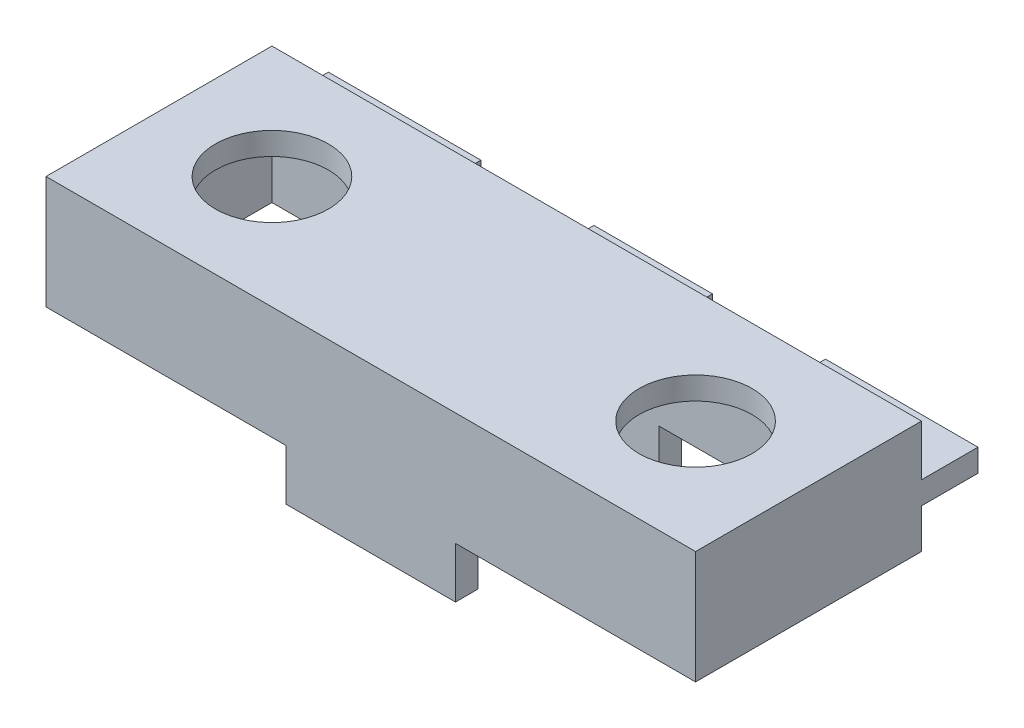
ISO-10303-21;
HEADER;
FILE_DESCRIPTION(('STEP AP214'),'2;1');
FILE_NAME('part.step','',(''),(''),'','','');
FILE_SCHEMA(('AUTOMOTIVE_DESIGN { 1 0 10303 214 1 1 1 1 }'));
ENDSEC;
DATA;
#1=APPLICATION_CONTEXT('core data for automotive mechanical design processes');
#2=APPLICATION_PROTOCOL_DEFINITION('international standard','automotive_design',2000,#1);
#3=PRODUCT_CONTEXT('',#1,'mechanical');
#4=PRODUCT('Part','Part','',(#3));
#5=PRODUCT_RELATED_PRODUCT_CATEGORY('part','',(#4));
#6=PRODUCT_DEFINITION_FORMATION('','',#4);
#7=PRODUCT_DEFINITION_CONTEXT('part definition',#1,'design');
#8=PRODUCT_DEFINITION('design','',#6,#7);
#9=PRODUCT_DEFINITION_SHAPE('','',#8);
#10=(LENGTH_UNIT() NAMED_UNIT(*) SI_UNIT(.MILLI.,.METRE.));
#11=(NAMED_UNIT(*) PLANE_ANGLE_UNIT() SI_UNIT($,.RADIAN.));
#12=(NAMED_UNIT(*) SI_UNIT($,.STERADIAN.) SOLID_ANGLE_UNIT());
#13=UNCERTAINTY_MEASURE_WITH_UNIT(LENGTH_MEASURE(1.E-05),#10,'distance_accuracy_value','');
#14=(GEOMETRIC_REPRESENTATION_CONTEXT(3) GLOBAL_UNCERTAINTY_ASSIGNED_CONTEXT((#13)) GLOBAL_UNIT_ASSIGNED_CONTEXT((#10,
#11,#12)) REPRESENTATION_CONTEXT('',''));
#15=CARTESIAN_POINT('',(0.,0.,0.));
#16=DIRECTION('',(0.,0.,1.));
#17=DIRECTION('',(1.,0.,0.));
#18=AXIS2_PLACEMENT_3D('',#15,#16,#17);
#19=CARTESIAN_POINT('',(0.,-25.4,-50.8));
#20=DIRECTION('',(0.,0.,-1.));
#21=DIRECTION('',(-1.,0.,0.));
#22=AXIS2_PLACEMENT_3D('',#19,#20,#21);
#23=PLANE('',#22);
#24=DIRECTION('',(-1.,0.,0.));
#25=VECTOR('',#24,1.);
#26=CARTESIAN_POINT('',(86.36,-16.51,-50.8));
#27=LINE('',#26,#25);
#28=CARTESIAN_POINT('',(86.36,-16.51,-50.8));
#29=VERTEX_POINT('',#28);
#30=CARTESIAN_POINT('',(59.69,-16.51,-50.8));
#31=VERTEX_POINT('',#30);
#32=EDGE_CURVE('E291',#29,#31,#27,.T.);
#33=ORIENTED_EDGE('',*,*,#32,.F.);
#34=DIRECTION('',(0.,-1.,0.));
#35=VECTOR('',#34,1.);
#36=CARTESIAN_POINT('',(86.36,-11.43,-50.8));
#37=LINE('',#36,#35);
#38=CARTESIAN_POINT('',(86.36,-11.43,-50.8));
#39=VERTEX_POINT('',#38);
#40=EDGE_CURVE('E288',#39,#29,#37,.T.);
#41=ORIENTED_EDGE('',*,*,#40,.F.);
#42=DIRECTION('',(1.,0.,0.));
#43=VECTOR('',#42,1.);
#44=CARTESIAN_POINT('',(86.36,-11.43,-50.8));
#45=LINE('',#44,#43);
#46=CARTESIAN_POINT('',(59.69,-11.43,-50.8));
#47=VERTEX_POINT('',#46);
#48=EDGE_CURVE('E301',#47,#39,#45,.T.);
#49=ORIENTED_EDGE('',*,*,#48,.F.);
#50=DIRECTION('',(0.,1.,0.));
#51=VECTOR('',#50,1.);
#52=CARTESIAN_POINT('',(59.69,-11.43,-50.8));
#53=LINE('',#52,#51);
#54=EDGE_CURVE('E309',#31,#47,#53,.T.);
#55=ORIENTED_EDGE('',*,*,#54,.F.);
#56=EDGE_LOOP('',(#33,#41,#49,#55));
#57=FACE_BOUND('',#56,.T.);
#58=DIRECTION('',(0.,1.,0.));
#59=VECTOR('',#58,1.);
#60=CARTESIAN_POINT('',(0.,-25.4,-50.8));
#61=LINE('',#60,#59);
#62=CARTESIAN_POINT('',(0.,-25.4,-50.8));
#63=VERTEX_POINT('',#62);
#64=CARTESIAN_POINT('',(0.,-16.51,-50.8));
#65=VERTEX_POINT('',#64);
#66=EDGE_CURVE('E12',#63,#65,#61,.T.);
#67=ORIENTED_EDGE('',*,*,#66,.T.);
#68=DIRECTION('',(-1.,0.,0.));
#69=VECTOR('',#68,1.);
#70=CARTESIAN_POINT('',(34.29,-16.51,-50.8));
#71=LINE('',#70,#69);
#72=CARTESIAN_POINT('',(34.29,-16.51,-50.8));
#73=VERTEX_POINT('',#72);
#74=EDGE_CURVE('E97',#73,#65,#71,.T.);
#75=ORIENTED_EDGE('',*,*,#74,.F.);
#76=DIRECTION('',(0.,-1.,0.));
#77=VECTOR('',#76,1.);
#78=CARTESIAN_POINT('',(34.29,-11.43,-50.8));
#79=LINE('',#78,#77);
#80=CARTESIAN_POINT('',(34.29,-11.43,-50.8));
#81=VERTEX_POINT('',#80);
#82=EDGE_CURVE('E102',#81,#73,#79,.T.);
#83=ORIENTED_EDGE('',*,*,#82,.F.);
#84=DIRECTION('',(1.,0.,0.));
#85=VECTOR('',#84,1.);
#86=CARTESIAN_POINT('',(34.29,-11.43,-50.8));
#87=LINE('',#86,#85);
#88=CARTESIAN_POINT('',(0.,-11.43,-50.8));
#89=VERTEX_POINT('',#88);
#90=EDGE_CURVE('E285',#89,#81,#87,.T.);
#91=ORIENTED_EDGE('',*,*,#90,.F.);
#92=CARTESIAN_POINT('',(0.,0.,-50.8));
#93=VERTEX_POINT('',#92);
#94=EDGE_CURVE('E90',#89,#93,#61,.T.);
#95=ORIENTED_EDGE('',*,*,#94,.T.);
#96=DIRECTION('',(-1.,0.,0.));
#97=VECTOR('',#96,1.);
#98=CARTESIAN_POINT('',(0.,0.,-50.8));
#99=LINE('',#98,#97);
#100=CARTESIAN_POINT('',(146.05,0.,-50.8));
#101=VERTEX_POINT('',#100);
#102=EDGE_CURVE('E449',#101,#93,#99,.T.);
#103=ORIENTED_EDGE('',*,*,#102,.F.);
#104=DIRECTION('',(0.,1.,0.));
#105=VECTOR('',#104,1.);
#106=CARTESIAN_POINT('',(146.05,-25.4,-50.8));
#107=LINE('',#106,#105);
#108=CARTESIAN_POINT('',(146.05,-11.43,-50.8));
#109=VERTEX_POINT('',#108);
#110=EDGE_CURVE('E474',#109,#101,#107,.T.);
#111=ORIENTED_EDGE('',*,*,#110,.F.);
#112=DIRECTION('',(1.,0.,0.));
#113=VECTOR('',#112,1.);
#114=CARTESIAN_POINT('',(146.05,-11.43,-50.8));
#115=LINE('',#114,#113);
#116=CARTESIAN_POINT('',(111.76,-11.43,-50.8));
#117=VERTEX_POINT('',#116);
#118=EDGE_CURVE('E327',#117,#109,#115,.T.);
#119=ORIENTED_EDGE('',*,*,#118,.F.);
#120=DIRECTION('',(0.,1.,0.));
#121=VECTOR('',#120,1.);
#122=CARTESIAN_POINT('',(111.76,-11.43,-50.8));
#123=LINE('',#122,#121);
#124=CARTESIAN_POINT('',(111.76,-16.51,-50.8));
#125=VERTEX_POINT('',#124);
#126=EDGE_CURVE('E336',#125,#117,#123,.T.);
#127=ORIENTED_EDGE('',*,*,#126,.F.);
#128=DIRECTION('',(-1.,0.,0.));
#129=VECTOR('',#128,1.);
#130=CARTESIAN_POINT('',(146.05,-16.51,-50.8));
#131=LINE('',#130,#129);
#132=CARTESIAN_POINT('',(146.05,-16.51,-50.8));
#133=VERTEX_POINT('',#132);
#134=EDGE_CURVE('E322',#133,#125,#131,.T.);
#135=ORIENTED_EDGE('',*,*,#134,.F.);
#136=CARTESIAN_POINT('',(146.05,-25.4,-50.8));
#137=VERTEX_POINT('',#136);
#138=EDGE_CURVE('E471',#137,#133,#107,.T.);
#139=ORIENTED_EDGE('',*,*,#138,.F.);
#140=DIRECTION('',(-1.,0.,0.));
#141=VECTOR('',#140,1.);
#142=CARTESIAN_POINT('',(0.,-25.4,-50.8));
#143=LINE('',#142,#141);
#144=CARTESIAN_POINT('',(92.075,-25.4,-50.8));
#145=VERTEX_POINT('',#144);
#146=EDGE_CURVE('E457',#137,#145,#143,.T.);
#147=ORIENTED_EDGE('',*,*,#146,.T.);
#148=DIRECTION('',(0.,1.,0.));
#149=VECTOR('',#148,1.);
#150=CARTESIAN_POINT('',(92.075,-36.83,-50.8));
#151=LINE('',#150,#149);
#152=CARTESIAN_POINT('',(92.075,-36.83,-50.8));
#153=VERTEX_POINT('',#152);
#154=EDGE_CURVE('E392',#153,#145,#151,.T.);
#155=ORIENTED_EDGE('',*,*,#154,.F.);
#156=DIRECTION('',(-1.,0.,0.));
#157=VECTOR('',#156,1.);
#158=CARTESIAN_POINT('',(73.025,-36.83,-50.8));
#159=LINE('',#158,#157);
#160=CARTESIAN_POINT('',(53.975,-36.83,-50.8));
#161=VERTEX_POINT('',#160);
#162=EDGE_CURVE('E381',#153,#161,#159,.T.);
#163=ORIENTED_EDGE('',*,*,#162,.T.);
#164=DIRECTION('',(0.,1.,0.));
#165=VECTOR('',#164,1.);
#166=CARTESIAN_POINT('',(53.975,-36.83,-50.8));
#167=LINE('',#166,#165);
#168=CARTESIAN_POINT('',(53.975,-25.4,-50.8));
#169=VERTEX_POINT('',#168);
#170=EDGE_CURVE('E389',#161,#169,#167,.T.);
#171=ORIENTED_EDGE('',*,*,#170,.T.);
#172=EDGE_CURVE('E456',#169,#63,#143,.T.);
#173=ORIENTED_EDGE('',*,*,#172,.T.);
#174=EDGE_LOOP('',(#67,#75,#83,#91,#95,#103,#111,#119,#127,#135,#139,#147,#155,#163,#171,#173));
#175=FACE_BOUND('',#174,.T.);
#176=ADVANCED_FACE('F81',(#57,#175),#23,.T.);
#177=CARTESIAN_POINT('',(0.,-25.4,0.));
#178=DIRECTION('',(0.,-1.,0.));
#179=DIRECTION('',(0.,0.,-1.));
#180=AXIS2_PLACEMENT_3D('',#177,#178,#179);
#181=PLANE('',#180);
#182=DIRECTION('',(0.,0.,-1.));
#183=VECTOR('',#182,1.);
#184=CARTESIAN_POINT('',(92.075,-25.4,0.));
#185=LINE('',#184,#183);
#186=CARTESIAN_POINT('',(92.075,-25.4,0.));
#187=VERTEX_POINT('',#186);
#188=CARTESIAN_POINT('',(92.075,-25.4,-5.08));
#189=VERTEX_POINT('',#188);
#190=EDGE_CURVE('E357',#187,#189,#185,.T.);
#191=ORIENTED_EDGE('',*,*,#190,.T.);
#192=DIRECTION('',(1.,0.,0.));
#193=VECTOR('',#192,1.);
#194=CARTESIAN_POINT('',(0.,-25.4,-5.08));
#195=LINE('',#194,#193);
#196=CARTESIAN_POINT('',(140.97,-25.4,-5.08));
#197=VERTEX_POINT('',#196);
#198=EDGE_CURVE('E436',#189,#197,#195,.T.);
#199=ORIENTED_EDGE('',*,*,#198,.T.);
#200=DIRECTION('',(0.,0.,-1.));
#201=VECTOR('',#200,1.);
#202=CARTESIAN_POINT('',(140.97,-25.4,0.));
#203=LINE('',#202,#201);
#204=CARTESIAN_POINT('',(140.97,-25.4,-45.72));
#205=VERTEX_POINT('',#204);
#206=EDGE_CURVE('E440',#197,#205,#203,.T.);
#207=ORIENTED_EDGE('',*,*,#206,.T.);
#208=DIRECTION('',(-1.,0.,0.));
#209=VECTOR('',#208,1.);
#210=CARTESIAN_POINT('',(0.,-25.4,-45.72));
#211=LINE('',#210,#209);
#212=CARTESIAN_POINT('',(92.075,-25.4,-45.72));
#213=VERTEX_POINT('',#212);
#214=EDGE_CURVE('E422',#205,#213,#211,.T.);
#215=ORIENTED_EDGE('',*,*,#214,.T.);
#216=DIRECTION('',(0.,0.,-1.));
#217=VECTOR('',#216,1.);
#218=CARTESIAN_POINT('',(92.075,-25.4,-45.72));
#219=LINE('',#218,#217);
#220=EDGE_CURVE('E363',#213,#145,#219,.T.);
#221=ORIENTED_EDGE('',*,*,#220,.T.);
#222=ORIENTED_EDGE('',*,*,#146,.F.);
#223=DIRECTION('',(0.,0.,-1.));
#224=VECTOR('',#223,1.);
#225=CARTESIAN_POINT('',(146.05,-25.4,0.));
#226=LINE('',#225,#224);
#227=CARTESIAN_POINT('',(146.05,-25.4,0.));
#228=VERTEX_POINT('',#227);
#229=EDGE_CURVE('E453',#228,#137,#226,.T.);
#230=ORIENTED_EDGE('',*,*,#229,.F.);
#231=DIRECTION('',(1.,0.,0.));
#232=VECTOR('',#231,1.);
#233=CARTESIAN_POINT('',(0.,-25.4,0.));
#234=LINE('',#233,#232);
#235=EDGE_CURVE('E448',#187,#228,#234,.T.);
#236=ORIENTED_EDGE('',*,*,#235,.F.);
#237=EDGE_LOOP('',(#191,#199,#207,#215,#221,#222,#230,#236));
#238=FACE_BOUND('',#237,.T.);
#239=ADVANCED_FACE('F530',(#238),#181,.T.);
#240=DIRECTION('',(0.,0.,1.));
#241=VECTOR('',#240,1.);
#242=CARTESIAN_POINT('',(53.975,-25.4,-5.08));
#243=LINE('',#242,#241);
#244=CARTESIAN_POINT('',(53.975,-25.4,-5.08));
#245=VERTEX_POINT('',#244);
#246=CARTESIAN_POINT('',(53.975,-25.4,0.));
#247=VERTEX_POINT('',#246);
#248=EDGE_CURVE('E361',#245,#247,#243,.T.);
#249=ORIENTED_EDGE('',*,*,#248,.T.);
#250=CARTESIAN_POINT('',(0.,-25.4,0.));
#251=VERTEX_POINT('',#250);
#252=EDGE_CURVE('E450',#251,#247,#234,.T.);
#253=ORIENTED_EDGE('',*,*,#252,.F.);
#254=DIRECTION('',(0.,0.,1.));
#255=VECTOR('',#254,1.);
#256=CARTESIAN_POINT('',(0.,-25.4,0.));
#257=LINE('',#256,#255);
#258=EDGE_CURVE('E445',#63,#251,#257,.T.);
#259=ORIENTED_EDGE('',*,*,#258,.F.);
#260=ORIENTED_EDGE('',*,*,#172,.F.);
#261=DIRECTION('',(0.,0.,-1.));
#262=VECTOR('',#261,1.);
#263=CARTESIAN_POINT('',(53.975,-25.4,-45.72));
#264=LINE('',#263,#262);
#265=CARTESIAN_POINT('',(53.975,-25.4,-45.72));
#266=VERTEX_POINT('',#265);
#267=EDGE_CURVE('E385',#266,#169,#264,.T.);
#268=ORIENTED_EDGE('',*,*,#267,.F.);
#269=CARTESIAN_POINT('',(5.08,-25.4,-45.72));
#270=VERTEX_POINT('',#269);
#271=EDGE_CURVE('E439',#266,#270,#211,.T.);
#272=ORIENTED_EDGE('',*,*,#271,.T.);
#273=DIRECTION('',(0.,0.,1.));
#274=VECTOR('',#273,1.);
#275=CARTESIAN_POINT('',(5.08,-25.4,0.));
#276=LINE('',#275,#274);
#277=CARTESIAN_POINT('',(5.08,-25.4,-5.08));
#278=VERTEX_POINT('',#277);
#279=EDGE_CURVE('E426',#270,#278,#276,.T.);
#280=ORIENTED_EDGE('',*,*,#279,.T.);
#281=EDGE_CURVE('E443',#278,#245,#195,.T.);
#282=ORIENTED_EDGE('',*,*,#281,.T.);
#283=EDGE_LOOP('',(#249,#253,#259,#260,#268,#272,#280,#282));
#284=FACE_BOUND('',#283,.T.);
#285=ADVANCED_FACE('F512',(#284),#181,.T.);
#286=CARTESIAN_POINT('',(0.,-25.4,0.));
#287=DIRECTION('',(-1.,0.,0.));
#288=DIRECTION('',(0.,0.,1.));
#289=AXIS2_PLACEMENT_3D('',#286,#287,#288);
#290=PLANE('',#289);
#291=DIRECTION('',(0.,0.,1.));
#292=VECTOR('',#291,1.);
#293=CARTESIAN_POINT('',(0.,0.,0.));
#294=LINE('',#293,#292);
#295=CARTESIAN_POINT('',(0.,0.,0.));
#296=VERTEX_POINT('',#295);
#297=EDGE_CURVE('E417',#93,#296,#294,.T.);
#298=ORIENTED_EDGE('',*,*,#297,.F.);
#299=ORIENTED_EDGE('',*,*,#94,.F.);
#300=DIRECTION('',(0.,0.,1.));
#301=VECTOR('',#300,1.);
#302=CARTESIAN_POINT('',(0.,-11.43,-63.5));
#303=LINE('',#302,#301);
#304=CARTESIAN_POINT('',(0.,-11.43,-63.5));
#305=VERTEX_POINT('',#304);
#306=EDGE_CURVE('E293',#305,#89,#303,.T.);
#307=ORIENTED_EDGE('',*,*,#306,.F.);
#308=DIRECTION('',(0.,1.,0.));
#309=VECTOR('',#308,1.);
#310=CARTESIAN_POINT('',(0.,-11.43,-63.5));
#311=LINE('',#310,#309);
#312=CARTESIAN_POINT('',(0.,-16.51,-63.5));
#313=VERTEX_POINT('',#312);
#314=EDGE_CURVE('E275',#313,#305,#311,.T.);
#315=ORIENTED_EDGE('',*,*,#314,.F.);
#316=DIRECTION('',(0.,0.,1.));
#317=VECTOR('',#316,1.);
#318=CARTESIAN_POINT('',(0.,-16.51,-63.5));
#319=LINE('',#318,#317);
#320=EDGE_CURVE('E272',#313,#65,#319,.T.);
#321=ORIENTED_EDGE('',*,*,#320,.T.);
#322=ORIENTED_EDGE('',*,*,#66,.F.);
#323=ORIENTED_EDGE('',*,*,#258,.T.);
#324=DIRECTION('',(0.,1.,0.));
#325=VECTOR('',#324,1.);
#326=CARTESIAN_POINT('',(0.,-25.4,0.));
#327=LINE('',#326,#325);
#328=EDGE_CURVE('E460',#251,#296,#327,.T.);
#329=ORIENTED_EDGE('',*,*,#328,.T.);
#330=EDGE_LOOP('',(#298,#299,#307,#315,#321,#322,#323,#329));
#331=FACE_BOUND('',#330,.T.);
#332=ADVANCED_FACE('F83',(#331),#290,.T.);
#333=CARTESIAN_POINT('',(146.05,-25.4,0.));
#334=DIRECTION('',(1.,0.,0.));
#335=DIRECTION('',(0.,0.,-1.));
#336=AXIS2_PLACEMENT_3D('',#333,#334,#335);
#337=PLANE('',#336);
#338=DIRECTION('',(0.,0.,-1.));
#339=VECTOR('',#338,1.);
#340=CARTESIAN_POINT('',(146.05,0.,0.));
#341=LINE('',#340,#339);
#342=CARTESIAN_POINT('',(146.05,0.,0.));
#343=VERTEX_POINT('',#342);
#344=EDGE_CURVE('E466',#343,#101,#341,.T.);
#345=ORIENTED_EDGE('',*,*,#344,.F.);
#346=DIRECTION('',(0.,1.,0.));
#347=VECTOR('',#346,1.);
#348=CARTESIAN_POINT('',(146.05,-25.4,0.));
#349=LINE('',#348,#347);
#350=EDGE_CURVE('E475',#228,#343,#349,.T.);
#351=ORIENTED_EDGE('',*,*,#350,.F.);
#352=ORIENTED_EDGE('',*,*,#229,.T.);
#353=ORIENTED_EDGE('',*,*,#138,.T.);
#354=DIRECTION('',(0.,0.,1.));
#355=VECTOR('',#354,1.);
#356=CARTESIAN_POINT('',(146.05,-16.51,-63.5));
#357=LINE('',#356,#355);
#358=CARTESIAN_POINT('',(146.05,-16.51,-63.5));
#359=VERTEX_POINT('',#358);
#360=EDGE_CURVE('E349',#359,#133,#357,.T.);
#361=ORIENTED_EDGE('',*,*,#360,.F.);
#362=DIRECTION('',(0.,-1.,0.));
#363=VECTOR('',#362,1.);
#364=CARTESIAN_POINT('',(146.05,-11.43,-63.5));
#365=LINE('',#364,#363);
#366=CARTESIAN_POINT('',(146.05,-11.43,-63.5));
#367=VERTEX_POINT('',#366);
#368=EDGE_CURVE('E323',#367,#359,#365,.T.);
#369=ORIENTED_EDGE('',*,*,#368,.F.);
#370=DIRECTION('',(0.,0.,1.));
#371=VECTOR('',#370,1.);
#372=CARTESIAN_POINT('',(146.05,-11.43,-63.5));
#373=LINE('',#372,#371);
#374=EDGE_CURVE('E333',#367,#109,#373,.T.);
#375=ORIENTED_EDGE('',*,*,#374,.T.);
#376=ORIENTED_EDGE('',*,*,#110,.T.);
#377=EDGE_LOOP('',(#345,#351,#352,#353,#361,#369,#375,#376));
#378=FACE_BOUND('',#377,.T.);
#379=ADVANCED_FACE('F556',(#378),#337,.T.);
#380=CARTESIAN_POINT('',(0.,-25.4,0.));
#381=DIRECTION('',(0.,0.,1.));
#382=DIRECTION('',(1.,0.,0.));
#383=AXIS2_PLACEMENT_3D('',#380,#381,#382);
#384=PLANE('',#383);
#385=DIRECTION('',(1.,0.,0.));
#386=VECTOR('',#385,1.);
#387=CARTESIAN_POINT('',(0.,0.,0.));
#388=LINE('',#387,#386);
#389=EDGE_CURVE('E463',#296,#343,#388,.T.);
#390=ORIENTED_EDGE('',*,*,#389,.F.);
#391=ORIENTED_EDGE('',*,*,#328,.F.);
#392=ORIENTED_EDGE('',*,*,#252,.T.);
#393=DIRECTION('',(0.,1.,0.));
#394=VECTOR('',#393,1.);
#395=CARTESIAN_POINT('',(53.975,-36.83,0.));
#396=LINE('',#395,#394);
#397=CARTESIAN_POINT('',(53.975,-36.83,0.));
#398=VERTEX_POINT('',#397);
#399=EDGE_CURVE('E353',#398,#247,#396,.T.);
#400=ORIENTED_EDGE('',*,*,#399,.F.);
#401=DIRECTION('',(-1.,0.,0.));
#402=VECTOR('',#401,1.);
#403=CARTESIAN_POINT('',(73.025,-36.83,0.));
#404=LINE('',#403,#402);
#405=CARTESIAN_POINT('',(92.075,-36.83,0.));
#406=VERTEX_POINT('',#405);
#407=EDGE_CURVE('E364',#406,#398,#404,.T.);
#408=ORIENTED_EDGE('',*,*,#407,.F.);
#409=DIRECTION('',(0.,1.,0.));
#410=VECTOR('',#409,1.);
#411=CARTESIAN_POINT('',(92.075,-36.83,0.));
#412=LINE('',#411,#410);
#413=EDGE_CURVE('E371',#406,#187,#412,.T.);
#414=ORIENTED_EDGE('',*,*,#413,.T.);
#415=ORIENTED_EDGE('',*,*,#235,.T.);
#416=ORIENTED_EDGE('',*,*,#350,.T.);
#417=EDGE_LOOP('',(#390,#391,#392,#400,#408,#414,#415,#416));
#418=FACE_BOUND('',#417,.T.);
#419=ADVANCED_FACE('F548',(#418),#384,.T.);
#420=CARTESIAN_POINT('',(0.,0.,0.));
#421=DIRECTION('',(0.,-1.,0.));
#422=DIRECTION('',(0.,0.,-1.));
#423=AXIS2_PLACEMENT_3D('',#420,#421,#422);
#424=PLANE('',#423);
#425=CARTESIAN_POINT('',(25.4,0.,-25.4));
#426=DIRECTION('',(0.,1.,0.));
#427=DIRECTION('',(0.,0.,1.));
#428=AXIS2_PLACEMENT_3D('',#425,#426,#427);
#429=CIRCLE('',#428,12.7);
#430=CARTESIAN_POINT('',(25.4,0.,-12.7));
#431=VERTEX_POINT('',#430);
#432=EDGE_CURVE('E405',#431,#431,#429,.T.);
#433=ORIENTED_EDGE('',*,*,#432,.F.);
#434=EDGE_LOOP('',(#433));
#435=FACE_BOUND('',#434,.T.);
#436=CARTESIAN_POINT('',(120.65,0.,-25.4));
#437=DIRECTION('',(0.,1.,0.));
#438=DIRECTION('',(0.,0.,1.));
#439=AXIS2_PLACEMENT_3D('',#436,#437,#438);
#440=CIRCLE('',#439,12.7);
#441=CARTESIAN_POINT('',(120.65,0.,-12.7));
#442=VERTEX_POINT('',#441);
#443=EDGE_CURVE('E395',#442,#442,#440,.T.);
#444=ORIENTED_EDGE('',*,*,#443,.F.);
#445=EDGE_LOOP('',(#444));
#446=FACE_BOUND('',#445,.T.);
#447=ORIENTED_EDGE('',*,*,#297,.T.);
#448=ORIENTED_EDGE('',*,*,#389,.T.);
#449=ORIENTED_EDGE('',*,*,#344,.T.);
#450=ORIENTED_EDGE('',*,*,#102,.T.);
#451=EDGE_LOOP('',(#447,#448,#449,#450));
#452=FACE_BOUND('',#451,.T.);
#453=ADVANCED_FACE('F560',(#435,#446,#452),#424,.F.);
#454=CARTESIAN_POINT('',(5.08,-25.4,0.));
#455=DIRECTION('',(-1.,0.,0.));
#456=DIRECTION('',(0.,0.,1.));
#457=AXIS2_PLACEMENT_3D('',#454,#455,#456);
#458=PLANE('',#457);
#459=DIRECTION('',(0.,0.,1.));
#460=VECTOR('',#459,1.);
#461=CARTESIAN_POINT('',(5.08,-5.08,0.));
#462=LINE('',#461,#460);
#463=CARTESIAN_POINT('',(5.08,-5.08,-45.72));
#464=VERTEX_POINT('',#463);
#465=CARTESIAN_POINT('',(5.08,-5.08,-5.08));
#466=VERTEX_POINT('',#465);
#467=EDGE_CURVE('E411',#464,#466,#462,.T.);
#468=ORIENTED_EDGE('',*,*,#467,.T.);
#469=DIRECTION('',(0.,1.,0.));
#470=VECTOR('',#469,1.);
#471=CARTESIAN_POINT('',(5.08,-25.4,-5.08));
#472=LINE('',#471,#470);
#473=EDGE_CURVE('E419',#278,#466,#472,.T.);
#474=ORIENTED_EDGE('',*,*,#473,.F.);
#475=ORIENTED_EDGE('',*,*,#279,.F.);
#476=DIRECTION('',(0.,1.,0.));
#477=VECTOR('',#476,1.);
#478=CARTESIAN_POINT('',(5.08,-25.4,-45.72));
#479=LINE('',#478,#477);
#480=EDGE_CURVE('E415',#270,#464,#479,.T.);
#481=ORIENTED_EDGE('',*,*,#480,.T.);
#482=EDGE_LOOP('',(#468,#474,#475,#481));
#483=FACE_BOUND('',#482,.T.);
#484=ADVANCED_FACE('F510',(#483),#458,.F.);
#485=CARTESIAN_POINT('',(0.,-25.4,-45.72));
#486=DIRECTION('',(0.,0.,-1.));
#487=DIRECTION('',(-1.,0.,0.));
#488=AXIS2_PLACEMENT_3D('',#485,#486,#487);
#489=PLANE('',#488);
#490=DIRECTION('',(-1.,0.,0.));
#491=VECTOR('',#490,1.);
#492=CARTESIAN_POINT('',(0.,-5.08,-45.72));
#493=LINE('',#492,#491);
#494=CARTESIAN_POINT('',(140.97,-5.08,-45.72));
#495=VERTEX_POINT('',#494);
#496=EDGE_CURVE('E423',#495,#464,#493,.T.);
#497=ORIENTED_EDGE('',*,*,#496,.T.);
#498=ORIENTED_EDGE('',*,*,#480,.F.);
#499=ORIENTED_EDGE('',*,*,#271,.F.);
#500=DIRECTION('',(0.,1.,0.));
#501=VECTOR('',#500,1.);
#502=CARTESIAN_POINT('',(53.975,-36.83,-45.72));
#503=LINE('',#502,#501);
#504=CARTESIAN_POINT('',(53.975,-36.83,-45.72));
#505=VERTEX_POINT('',#504);
#506=EDGE_CURVE('E393',#505,#266,#503,.T.);
#507=ORIENTED_EDGE('',*,*,#506,.F.);
#508=DIRECTION('',(-1.,0.,0.));
#509=VECTOR('',#508,1.);
#510=CARTESIAN_POINT('',(73.025,-36.83,-45.72));
#511=LINE('',#510,#509);
#512=CARTESIAN_POINT('',(92.075,-36.83,-45.72));
#513=VERTEX_POINT('',#512);
#514=EDGE_CURVE('E387',#513,#505,#511,.T.);
#515=ORIENTED_EDGE('',*,*,#514,.F.);
#516=DIRECTION('',(0.,1.,0.));
#517=VECTOR('',#516,1.);
#518=CARTESIAN_POINT('',(92.075,-36.83,-45.72));
#519=LINE('',#518,#517);
#520=EDGE_CURVE('E400',#513,#213,#519,.T.);
#521=ORIENTED_EDGE('',*,*,#520,.T.);
#522=ORIENTED_EDGE('',*,*,#214,.F.);
#523=DIRECTION('',(0.,1.,0.));
#524=VECTOR('',#523,1.);
#525=CARTESIAN_POINT('',(140.97,-25.4,-45.72));
#526=LINE('',#525,#524);
#527=EDGE_CURVE('E418',#205,#495,#526,.T.);
#528=ORIENTED_EDGE('',*,*,#527,.T.);
#529=EDGE_LOOP('',(#497,#498,#499,#507,#515,#521,#522,#528));
#530=FACE_BOUND('',#529,.T.);
#531=ADVANCED_FACE('F500',(#530),#489,.F.);
#532=CARTESIAN_POINT('',(140.97,-25.4,0.));
#533=DIRECTION('',(1.,0.,0.));
#534=DIRECTION('',(0.,0.,-1.));
#535=AXIS2_PLACEMENT_3D('',#532,#533,#534);
#536=PLANE('',#535);
#537=DIRECTION('',(0.,0.,-1.));
#538=VECTOR('',#537,1.);
#539=CARTESIAN_POINT('',(140.97,-5.08,0.));
#540=LINE('',#539,#538);
#541=CARTESIAN_POINT('',(140.97,-5.08,-5.08));
#542=VERTEX_POINT('',#541);
#543=EDGE_CURVE('E427',#542,#495,#540,.T.);
#544=ORIENTED_EDGE('',*,*,#543,.T.);
#545=ORIENTED_EDGE('',*,*,#527,.F.);
#546=ORIENTED_EDGE('',*,*,#206,.F.);
#547=DIRECTION('',(0.,1.,0.));
#548=VECTOR('',#547,1.);
#549=CARTESIAN_POINT('',(140.97,-25.4,-5.08));
#550=LINE('',#549,#548);
#551=EDGE_CURVE('E421',#197,#542,#550,.T.);
#552=ORIENTED_EDGE('',*,*,#551,.T.);
#553=EDGE_LOOP('',(#544,#545,#546,#552));
#554=FACE_BOUND('',#553,.T.);
#555=ADVANCED_FACE('F506',(#554),#536,.F.);
#556=CARTESIAN_POINT('',(0.,-25.4,-5.08));
#557=DIRECTION('',(0.,0.,1.));
#558=DIRECTION('',(1.,0.,0.));
#559=AXIS2_PLACEMENT_3D('',#556,#557,#558);
#560=PLANE('',#559);
#561=DIRECTION('',(1.,0.,0.));
#562=VECTOR('',#561,1.);
#563=CARTESIAN_POINT('',(0.,-5.08,-5.08));
#564=LINE('',#563,#562);
#565=EDGE_CURVE('E414',#466,#542,#564,.T.);
#566=ORIENTED_EDGE('',*,*,#565,.T.);
#567=ORIENTED_EDGE('',*,*,#551,.F.);
#568=ORIENTED_EDGE('',*,*,#198,.F.);
#569=DIRECTION('',(0.,1.,0.));
#570=VECTOR('',#569,1.);
#571=CARTESIAN_POINT('',(92.075,-36.83,-5.08));
#572=LINE('',#571,#570);
#573=CARTESIAN_POINT('',(92.075,-36.83,-5.08));
#574=VERTEX_POINT('',#573);
#575=EDGE_CURVE('E352',#574,#189,#572,.T.);
#576=ORIENTED_EDGE('',*,*,#575,.F.);
#577=DIRECTION('',(-1.,0.,0.));
#578=VECTOR('',#577,1.);
#579=CARTESIAN_POINT('',(73.025,-36.83,-5.08));
#580=LINE('',#579,#578);
#581=CARTESIAN_POINT('',(53.975,-36.83,-5.08));
#582=VERTEX_POINT('',#581);
#583=EDGE_CURVE('E360',#574,#582,#580,.T.);
#584=ORIENTED_EDGE('',*,*,#583,.T.);
#585=DIRECTION('',(0.,1.,0.));
#586=VECTOR('',#585,1.);
#587=CARTESIAN_POINT('',(53.975,-36.83,-5.08));
#588=LINE('',#587,#586);
#589=EDGE_CURVE('E356',#582,#245,#588,.T.);
#590=ORIENTED_EDGE('',*,*,#589,.T.);
#591=ORIENTED_EDGE('',*,*,#281,.F.);
#592=ORIENTED_EDGE('',*,*,#473,.T.);
#593=EDGE_LOOP('',(#566,#567,#568,#576,#584,#590,#591,#592));
#594=FACE_BOUND('',#593,.T.);
#595=ADVANCED_FACE('F490',(#594),#560,.F.);
#596=CARTESIAN_POINT('',(0.,-5.08,0.));
#597=DIRECTION('',(0.,-1.,0.));
#598=DIRECTION('',(0.,0.,-1.));
#599=AXIS2_PLACEMENT_3D('',#596,#597,#598);
#600=PLANE('',#599);
#601=CARTESIAN_POINT('',(25.4,-5.08,-25.4));
#602=DIRECTION('',(0.,-1.,0.));
#603=DIRECTION('',(0.,0.,-1.));
#604=AXIS2_PLACEMENT_3D('',#601,#602,#603);
#605=CIRCLE('',#604,12.7);
#606=CARTESIAN_POINT('',(25.4,-5.08,-38.1));
#607=VERTEX_POINT('',#606);
#608=EDGE_CURVE('E85',#607,#607,#605,.T.);
#609=ORIENTED_EDGE('',*,*,#608,.F.);
#610=EDGE_LOOP('',(#609));
#611=FACE_BOUND('',#610,.T.);
#612=CARTESIAN_POINT('',(120.65,-5.08,-25.4));
#613=DIRECTION('',(0.,-1.,0.));
#614=DIRECTION('',(0.,0.,-1.));
#615=AXIS2_PLACEMENT_3D('',#612,#613,#614);
#616=CIRCLE('',#615,12.7);
#617=CARTESIAN_POINT('',(120.65,-5.08,-38.1));
#618=VERTEX_POINT('',#617);
#619=EDGE_CURVE('E408',#618,#618,#616,.T.);
#620=ORIENTED_EDGE('',*,*,#619,.F.);
#621=EDGE_LOOP('',(#620));
#622=FACE_BOUND('',#621,.T.);
#623=ORIENTED_EDGE('',*,*,#467,.F.);
#624=ORIENTED_EDGE('',*,*,#496,.F.);
#625=ORIENTED_EDGE('',*,*,#543,.F.);
#626=ORIENTED_EDGE('',*,*,#565,.F.);
#627=EDGE_LOOP('',(#623,#624,#625,#626));
#628=FACE_BOUND('',#627,.T.);
#629=ADVANCED_FACE('F486',(#611,#622,#628),#600,.T.);
#630=CARTESIAN_POINT('',(120.65,-6.35,-25.4));
#631=DIRECTION('',(0.,1.,0.));
#632=DIRECTION('',(0.,0.,1.));
#633=AXIS2_PLACEMENT_3D('',#630,#631,#632);
#634=CYLINDRICAL_SURFACE('',#633,12.7);
#635=ORIENTED_EDGE('',*,*,#619,.T.);
#636=EDGE_LOOP('',(#635));
#637=FACE_BOUND('',#636,.T.);
#638=ORIENTED_EDGE('',*,*,#443,.T.);
#639=EDGE_LOOP('',(#638));
#640=FACE_BOUND('',#639,.T.);
#641=ADVANCED_FACE('F489',(#637,#640),#634,.F.);
#642=CARTESIAN_POINT('',(25.4,-6.35,-25.4));
#643=DIRECTION('',(0.,1.,0.));
#644=DIRECTION('',(0.,0.,1.));
#645=AXIS2_PLACEMENT_3D('',#642,#643,#644);
#646=CYLINDRICAL_SURFACE('',#645,12.7);
#647=ORIENTED_EDGE('',*,*,#608,.T.);
#648=EDGE_LOOP('',(#647));
#649=FACE_BOUND('',#648,.T.);
#650=ORIENTED_EDGE('',*,*,#432,.T.);
#651=EDGE_LOOP('',(#650));
#652=FACE_BOUND('',#651,.T.);
#653=ADVANCED_FACE('F483',(#649,#652),#646,.F.);
#654=CARTESIAN_POINT('',(53.975,-36.83,-45.72));
#655=DIRECTION('',(1.,0.,0.));
#656=DIRECTION('',(0.,0.,-1.));
#657=AXIS2_PLACEMENT_3D('',#654,#655,#656);
#658=PLANE('',#657);
#659=ORIENTED_EDGE('',*,*,#267,.T.);
#660=ORIENTED_EDGE('',*,*,#170,.F.);
#661=DIRECTION('',(0.,0.,-1.));
#662=VECTOR('',#661,1.);
#663=CARTESIAN_POINT('',(53.975,-36.83,-45.72));
#664=LINE('',#663,#662);
#665=EDGE_CURVE('E384',#505,#161,#664,.T.);
#666=ORIENTED_EDGE('',*,*,#665,.F.);
#667=ORIENTED_EDGE('',*,*,#506,.T.);
#668=EDGE_LOOP('',(#659,#660,#666,#667));
#669=FACE_BOUND('',#668,.T.);
#670=ADVANCED_FACE('F520',(#669),#658,.F.);
#671=CARTESIAN_POINT('',(0.,-36.83,0.));
#672=DIRECTION('',(0.,-1.,0.));
#673=DIRECTION('',(0.,0.,-1.));
#674=AXIS2_PLACEMENT_3D('',#671,#672,#673);
#675=PLANE('',#674);
#676=ORIENTED_EDGE('',*,*,#162,.F.);
#677=DIRECTION('',(0.,0.,-1.));
#678=VECTOR('',#677,1.);
#679=CARTESIAN_POINT('',(92.075,-36.83,-45.72));
#680=LINE('',#679,#678);
#681=EDGE_CURVE('E397',#513,#153,#680,.T.);
#682=ORIENTED_EDGE('',*,*,#681,.F.);
#683=ORIENTED_EDGE('',*,*,#514,.T.);
#684=ORIENTED_EDGE('',*,*,#665,.T.);
#685=EDGE_LOOP('',(#676,#682,#683,#684));
#686=FACE_BOUND('',#685,.T.);
#687=ADVANCED_FACE('F522',(#686),#675,.T.);
#688=CARTESIAN_POINT('',(92.075,-36.83,-45.72));
#689=DIRECTION('',(1.,0.,0.));
#690=DIRECTION('',(0.,0.,-1.));
#691=AXIS2_PLACEMENT_3D('',#688,#689,#690);
#692=PLANE('',#691);
#693=ORIENTED_EDGE('',*,*,#220,.F.);
#694=ORIENTED_EDGE('',*,*,#520,.F.);
#695=ORIENTED_EDGE('',*,*,#681,.T.);
#696=ORIENTED_EDGE('',*,*,#154,.T.);
#697=EDGE_LOOP('',(#693,#694,#695,#696));
#698=FACE_BOUND('',#697,.T.);
#699=ADVANCED_FACE('F527',(#698),#692,.T.);
#700=CARTESIAN_POINT('',(92.075,-36.83,0.));
#701=DIRECTION('',(1.,0.,0.));
#702=DIRECTION('',(0.,0.,-1.));
#703=AXIS2_PLACEMENT_3D('',#700,#701,#702);
#704=PLANE('',#703);
#705=ORIENTED_EDGE('',*,*,#190,.F.);
#706=ORIENTED_EDGE('',*,*,#413,.F.);
#707=DIRECTION('',(0.,0.,-1.));
#708=VECTOR('',#707,1.);
#709=CARTESIAN_POINT('',(92.075,-36.83,0.));
#710=LINE('',#709,#708);
#711=EDGE_CURVE('E374',#406,#574,#710,.T.);
#712=ORIENTED_EDGE('',*,*,#711,.T.);
#713=ORIENTED_EDGE('',*,*,#575,.T.);
#714=EDGE_LOOP('',(#705,#706,#712,#713));
#715=FACE_BOUND('',#714,.T.);
#716=ADVANCED_FACE('F536',(#715),#704,.T.);
#717=CARTESIAN_POINT('',(0.,-36.83,0.));
#718=DIRECTION('',(0.,1.,0.));
#719=DIRECTION('',(0.,0.,1.));
#720=AXIS2_PLACEMENT_3D('',#717,#718,#719);
#721=PLANE('',#720);
#722=ORIENTED_EDGE('',*,*,#583,.F.);
#723=ORIENTED_EDGE('',*,*,#711,.F.);
#724=ORIENTED_EDGE('',*,*,#407,.T.);
#725=DIRECTION('',(0.,0.,1.));
#726=VECTOR('',#725,1.);
#727=CARTESIAN_POINT('',(53.975,-36.83,-5.08));
#728=LINE('',#727,#726);
#729=EDGE_CURVE('E367',#582,#398,#728,.T.);
#730=ORIENTED_EDGE('',*,*,#729,.F.);
#731=EDGE_LOOP('',(#722,#723,#724,#730));
#732=FACE_BOUND('',#731,.T.);
#733=ADVANCED_FACE('F538',(#732),#721,.F.);
#734=CARTESIAN_POINT('',(53.975,-36.83,-5.08));
#735=DIRECTION('',(-1.,0.,0.));
#736=DIRECTION('',(0.,0.,1.));
#737=AXIS2_PLACEMENT_3D('',#734,#735,#736);
#738=PLANE('',#737);
#739=ORIENTED_EDGE('',*,*,#248,.F.);
#740=ORIENTED_EDGE('',*,*,#589,.F.);
#741=ORIENTED_EDGE('',*,*,#729,.T.);
#742=ORIENTED_EDGE('',*,*,#399,.T.);
#743=EDGE_LOOP('',(#739,#740,#741,#742));
#744=FACE_BOUND('',#743,.T.);
#745=ADVANCED_FACE('F543',(#744),#738,.T.);
#746=CARTESIAN_POINT('',(146.05,-16.51,-63.5));
#747=DIRECTION('',(0.,1.,0.));
#748=DIRECTION('',(0.,0.,1.));
#749=AXIS2_PLACEMENT_3D('',#746,#747,#748);
#750=PLANE('',#749);
#751=ORIENTED_EDGE('',*,*,#134,.T.);
#752=DIRECTION('',(0.,0.,1.));
#753=VECTOR('',#752,1.);
#754=CARTESIAN_POINT('',(111.76,-16.51,-63.5));
#755=LINE('',#754,#753);
#756=CARTESIAN_POINT('',(111.76,-16.51,-63.5));
#757=VERTEX_POINT('',#756);
#758=EDGE_CURVE('E346',#757,#125,#755,.T.);
#759=ORIENTED_EDGE('',*,*,#758,.F.);
#760=DIRECTION('',(-1.,0.,0.));
#761=VECTOR('',#760,1.);
#762=CARTESIAN_POINT('',(146.05,-16.51,-63.5));
#763=LINE('',#762,#761);
#764=EDGE_CURVE('E326',#359,#757,#763,.T.);
#765=ORIENTED_EDGE('',*,*,#764,.F.);
#766=ORIENTED_EDGE('',*,*,#360,.T.);
#767=EDGE_LOOP('',(#751,#759,#765,#766));
#768=FACE_BOUND('',#767,.T.);
#769=ADVANCED_FACE('F634',(#768),#750,.F.);
#770=CARTESIAN_POINT('',(111.76,-11.43,-63.5));
#771=DIRECTION('',(1.,0.,0.));
#772=DIRECTION('',(0.,0.,-1.));
#773=AXIS2_PLACEMENT_3D('',#770,#771,#772);
#774=PLANE('',#773);
#775=ORIENTED_EDGE('',*,*,#126,.T.);
#776=DIRECTION('',(0.,0.,1.));
#777=VECTOR('',#776,1.);
#778=CARTESIAN_POINT('',(111.76,-11.43,-63.5));
#779=LINE('',#778,#777);
#780=CARTESIAN_POINT('',(111.76,-11.43,-63.5));
#781=VERTEX_POINT('',#780);
#782=EDGE_CURVE('E343',#781,#117,#779,.T.);
#783=ORIENTED_EDGE('',*,*,#782,.F.);
#784=DIRECTION('',(0.,1.,0.));
#785=VECTOR('',#784,1.);
#786=CARTESIAN_POINT('',(111.76,-11.43,-63.5));
#787=LINE('',#786,#785);
#788=EDGE_CURVE('E329',#757,#781,#787,.T.);
#789=ORIENTED_EDGE('',*,*,#788,.F.);
#790=ORIENTED_EDGE('',*,*,#758,.T.);
#791=EDGE_LOOP('',(#775,#783,#789,#790));
#792=FACE_BOUND('',#791,.T.);
#793=ADVANCED_FACE('F638',(#792),#774,.F.);
#794=CARTESIAN_POINT('',(146.05,-11.43,-63.5));
#795=DIRECTION('',(0.,-1.,0.));
#796=DIRECTION('',(0.,0.,-1.));
#797=AXIS2_PLACEMENT_3D('',#794,#795,#796);
#798=PLANE('',#797);
#799=ORIENTED_EDGE('',*,*,#118,.T.);
#800=ORIENTED_EDGE('',*,*,#374,.F.);
#801=DIRECTION('',(1.,0.,0.));
#802=VECTOR('',#801,1.);
#803=CARTESIAN_POINT('',(146.05,-11.43,-63.5));
#804=LINE('',#803,#802);
#805=EDGE_CURVE('E331',#781,#367,#804,.T.);
#806=ORIENTED_EDGE('',*,*,#805,.F.);
#807=ORIENTED_EDGE('',*,*,#782,.T.);
#808=EDGE_LOOP('',(#799,#800,#806,#807));
#809=FACE_BOUND('',#808,.T.);
#810=ADVANCED_FACE('F649',(#809),#798,.F.);
#811=CARTESIAN_POINT('',(0.,0.,-63.5));
#812=DIRECTION('',(0.,0.,-1.));
#813=DIRECTION('',(-1.,0.,0.));
#814=AXIS2_PLACEMENT_3D('',#811,#812,#813);
#815=PLANE('',#814);
#816=ORIENTED_EDGE('',*,*,#368,.T.);
#817=ORIENTED_EDGE('',*,*,#764,.T.);
#818=ORIENTED_EDGE('',*,*,#788,.T.);
#819=ORIENTED_EDGE('',*,*,#805,.T.);
#820=EDGE_LOOP('',(#816,#817,#818,#819));
#821=FACE_BOUND('',#820,.T.);
#822=ADVANCED_FACE('F659',(#821),#815,.T.);
#823=CARTESIAN_POINT('',(86.36,-11.43,-63.5));
#824=DIRECTION('',(-1.,0.,0.));
#825=DIRECTION('',(0.,0.,1.));
#826=AXIS2_PLACEMENT_3D('',#823,#824,#825);
#827=PLANE('',#826);
#828=ORIENTED_EDGE('',*,*,#40,.T.);
#829=DIRECTION('',(0.,0.,1.));
#830=VECTOR('',#829,1.);
#831=CARTESIAN_POINT('',(86.36,-16.51,-63.5));
#832=LINE('',#831,#830);
#833=CARTESIAN_POINT('',(86.36,-16.51,-63.5));
#834=VERTEX_POINT('',#833);
#835=EDGE_CURVE('E320',#834,#29,#832,.T.);
#836=ORIENTED_EDGE('',*,*,#835,.F.);
#837=DIRECTION('',(0.,-1.,0.));
#838=VECTOR('',#837,1.);
#839=CARTESIAN_POINT('',(86.36,-11.43,-63.5));
#840=LINE('',#839,#838);
#841=CARTESIAN_POINT('',(86.36,-11.43,-63.5));
#842=VERTEX_POINT('',#841);
#843=EDGE_CURVE('E297',#842,#834,#840,.T.);
#844=ORIENTED_EDGE('',*,*,#843,.F.);
#845=DIRECTION('',(0.,0.,1.));
#846=VECTOR('',#845,1.);
#847=CARTESIAN_POINT('',(86.36,-11.43,-63.5));
#848=LINE('',#847,#846);
#849=EDGE_CURVE('E306',#842,#39,#848,.T.);
#850=ORIENTED_EDGE('',*,*,#849,.T.);
#851=EDGE_LOOP('',(#828,#836,#844,#850));
#852=FACE_BOUND('',#851,.T.);
#853=ADVANCED_FACE('F669',(#852),#827,.F.);
#854=CARTESIAN_POINT('',(86.36,-16.51,-63.5));
#855=DIRECTION('',(0.,1.,0.));
#856=DIRECTION('',(0.,0.,1.));
#857=AXIS2_PLACEMENT_3D('',#854,#855,#856);
#858=PLANE('',#857);
#859=ORIENTED_EDGE('',*,*,#32,.T.);
#860=DIRECTION('',(0.,0.,1.));
#861=VECTOR('',#860,1.);
#862=CARTESIAN_POINT('',(59.69,-16.51,-63.5));
#863=LINE('',#862,#861);
#864=CARTESIAN_POINT('',(59.69,-16.51,-63.5));
#865=VERTEX_POINT('',#864);
#866=EDGE_CURVE('E317',#865,#31,#863,.T.);
#867=ORIENTED_EDGE('',*,*,#866,.F.);
#868=DIRECTION('',(-1.,0.,0.));
#869=VECTOR('',#868,1.);
#870=CARTESIAN_POINT('',(86.36,-16.51,-63.5));
#871=LINE('',#870,#869);
#872=EDGE_CURVE('E300',#834,#865,#871,.T.);
#873=ORIENTED_EDGE('',*,*,#872,.F.);
#874=ORIENTED_EDGE('',*,*,#835,.T.);
#875=EDGE_LOOP('',(#859,#867,#873,#874));
#876=FACE_BOUND('',#875,.T.);
#877=ADVANCED_FACE('F679',(#876),#858,.F.);
#878=CARTESIAN_POINT('',(59.69,-11.43,-63.5));
#879=DIRECTION('',(1.,0.,0.));
#880=DIRECTION('',(0.,0.,-1.));
#881=AXIS2_PLACEMENT_3D('',#878,#879,#880);
#882=PLANE('',#881);
#883=ORIENTED_EDGE('',*,*,#54,.T.);
#884=DIRECTION('',(0.,0.,1.));
#885=VECTOR('',#884,1.);
#886=CARTESIAN_POINT('',(59.69,-11.43,-63.5));
#887=LINE('',#886,#885);
#888=CARTESIAN_POINT('',(59.69,-11.43,-63.5));
#889=VERTEX_POINT('',#888);
#890=EDGE_CURVE('E315',#889,#47,#887,.T.);
#891=ORIENTED_EDGE('',*,*,#890,.F.);
#892=DIRECTION('',(0.,1.,0.));
#893=VECTOR('',#892,1.);
#894=CARTESIAN_POINT('',(59.69,-11.43,-63.5));
#895=LINE('',#894,#893);
#896=EDGE_CURVE('E303',#865,#889,#895,.T.);
#897=ORIENTED_EDGE('',*,*,#896,.F.);
#898=ORIENTED_EDGE('',*,*,#866,.T.);
#899=EDGE_LOOP('',(#883,#891,#897,#898));
#900=FACE_BOUND('',#899,.T.);
#901=ADVANCED_FACE('F689',(#900),#882,.F.);
#902=CARTESIAN_POINT('',(86.36,-11.43,-63.5));
#903=DIRECTION('',(0.,-1.,0.));
#904=DIRECTION('',(0.,0.,-1.));
#905=AXIS2_PLACEMENT_3D('',#902,#903,#904);
#906=PLANE('',#905);
#907=ORIENTED_EDGE('',*,*,#48,.T.);
#908=ORIENTED_EDGE('',*,*,#849,.F.);
#909=DIRECTION('',(1.,0.,0.));
#910=VECTOR('',#909,1.);
#911=CARTESIAN_POINT('',(86.36,-11.43,-63.5));
#912=LINE('',#911,#910);
#913=EDGE_CURVE('E305',#889,#842,#912,.T.);
#914=ORIENTED_EDGE('',*,*,#913,.F.);
#915=ORIENTED_EDGE('',*,*,#890,.T.);
#916=EDGE_LOOP('',(#907,#908,#914,#915));
#917=FACE_BOUND('',#916,.T.);
#918=ADVANCED_FACE('F699',(#917),#906,.F.);
#919=CARTESIAN_POINT('',(0.,0.,-63.5));
#920=DIRECTION('',(0.,0.,-1.));
#921=DIRECTION('',(-1.,0.,0.));
#922=AXIS2_PLACEMENT_3D('',#919,#920,#921);
#923=PLANE('',#922);
#924=ORIENTED_EDGE('',*,*,#843,.T.);
#925=ORIENTED_EDGE('',*,*,#872,.T.);
#926=ORIENTED_EDGE('',*,*,#896,.T.);
#927=ORIENTED_EDGE('',*,*,#913,.T.);
#928=EDGE_LOOP('',(#924,#925,#926,#927));
#929=FACE_BOUND('',#928,.T.);
#930=ADVANCED_FACE('F709',(#929),#923,.T.);
#931=CARTESIAN_POINT('',(34.29,-11.43,-63.5));
#932=DIRECTION('',(-1.,0.,0.));
#933=DIRECTION('',(0.,0.,1.));
#934=AXIS2_PLACEMENT_3D('',#931,#932,#933);
#935=PLANE('',#934);
#936=ORIENTED_EDGE('',*,*,#82,.T.);
#937=DIRECTION('',(0.,0.,1.));
#938=VECTOR('',#937,1.);
#939=CARTESIAN_POINT('',(34.29,-16.51,-63.5));
#940=LINE('',#939,#938);
#941=CARTESIAN_POINT('',(34.29,-16.51,-63.5));
#942=VERTEX_POINT('',#941);
#943=EDGE_CURVE('E270',#942,#73,#940,.T.);
#944=ORIENTED_EDGE('',*,*,#943,.F.);
#945=DIRECTION('',(0.,-1.,0.));
#946=VECTOR('',#945,1.);
#947=CARTESIAN_POINT('',(34.29,-11.43,-63.5));
#948=LINE('',#947,#946);
#949=CARTESIAN_POINT('',(34.29,-11.43,-63.5));
#950=VERTEX_POINT('',#949);
#951=EDGE_CURVE('E276',#950,#942,#948,.T.);
#952=ORIENTED_EDGE('',*,*,#951,.F.);
#953=DIRECTION('',(0.,0.,1.));
#954=VECTOR('',#953,1.);
#955=CARTESIAN_POINT('',(34.29,-11.43,-63.5));
#956=LINE('',#955,#954);
#957=EDGE_CURVE('E564',#950,#81,#956,.T.);
#958=ORIENTED_EDGE('',*,*,#957,.T.);
#959=EDGE_LOOP('',(#936,#944,#952,#958));
#960=FACE_BOUND('',#959,.T.);
#961=ADVANCED_FACE('F287',(#960),#935,.F.);
#962=CARTESIAN_POINT('',(34.29,-16.51,-63.5));
#963=DIRECTION('',(0.,1.,0.));
#964=DIRECTION('',(0.,0.,1.));
#965=AXIS2_PLACEMENT_3D('',#962,#963,#964);
#966=PLANE('',#965);
#967=ORIENTED_EDGE('',*,*,#74,.T.);
#968=ORIENTED_EDGE('',*,*,#320,.F.);
#969=DIRECTION('',(-1.,0.,0.));
#970=VECTOR('',#969,1.);
#971=CARTESIAN_POINT('',(34.29,-16.51,-63.5));
#972=LINE('',#971,#970);
#973=EDGE_CURVE('E266',#942,#313,#972,.T.);
#974=ORIENTED_EDGE('',*,*,#973,.F.);
#975=ORIENTED_EDGE('',*,*,#943,.T.);
#976=EDGE_LOOP('',(#967,#968,#974,#975));
#977=FACE_BOUND('',#976,.T.);
#978=ADVANCED_FACE('F268',(#977),#966,.F.);
#979=CARTESIAN_POINT('',(34.29,-11.43,-63.5));
#980=DIRECTION('',(0.,-1.,0.));
#981=DIRECTION('',(0.,0.,-1.));
#982=AXIS2_PLACEMENT_3D('',#979,#980,#981);
#983=PLANE('',#982);
#984=ORIENTED_EDGE('',*,*,#90,.T.);
#985=ORIENTED_EDGE('',*,*,#957,.F.);
#986=DIRECTION('',(1.,0.,0.));
#987=VECTOR('',#986,1.);
#988=CARTESIAN_POINT('',(34.29,-11.43,-63.5));
#989=LINE('',#988,#987);
#990=EDGE_CURVE('E281',#305,#950,#989,.T.);
#991=ORIENTED_EDGE('',*,*,#990,.F.);
#992=ORIENTED_EDGE('',*,*,#306,.T.);
#993=EDGE_LOOP('',(#984,#985,#991,#992));
#994=FACE_BOUND('',#993,.T.);
#995=ADVANCED_FACE('F565',(#994),#983,.F.);
#996=CARTESIAN_POINT('',(0.,0.,-63.5));
#997=DIRECTION('',(0.,0.,-1.));
#998=DIRECTION('',(-1.,0.,0.));
#999=AXIS2_PLACEMENT_3D('',#996,#997,#998);
#1000=PLANE('',#999);
#1001=ORIENTED_EDGE('',*,*,#951,.T.);
#1002=ORIENTED_EDGE('',*,*,#973,.T.);
#1003=ORIENTED_EDGE('',*,*,#314,.T.);
#1004=ORIENTED_EDGE('',*,*,#990,.T.);
#1005=EDGE_LOOP('',(#1001,#1002,#1003,#1004));
#1006=FACE_BOUND('',#1005,.T.);
#1007=ADVANCED_FACE('F279',(#1006),#1000,.T.);
#1008=CLOSED_SHELL('',(#176,#239,#285,#332,#379,#419,#453,#484,#531,#555,#595,#629,#641,#653,
#670,#687,#699,#716,#733,#745,#769,#793,#810,#822,#853,#877,#901,#918,#930,#961,#978,#995,#1007));
#1009=MANIFOLD_SOLID_BREP('B2',#1008);
#1010=ADVANCED_BREP_SHAPE_REPRESENTATION('',(#18,#1009),#14);
#1011=SHAPE_DEFINITION_REPRESENTATION(#9,#1010);
ENDSEC;
END-ISO-10303-21;
